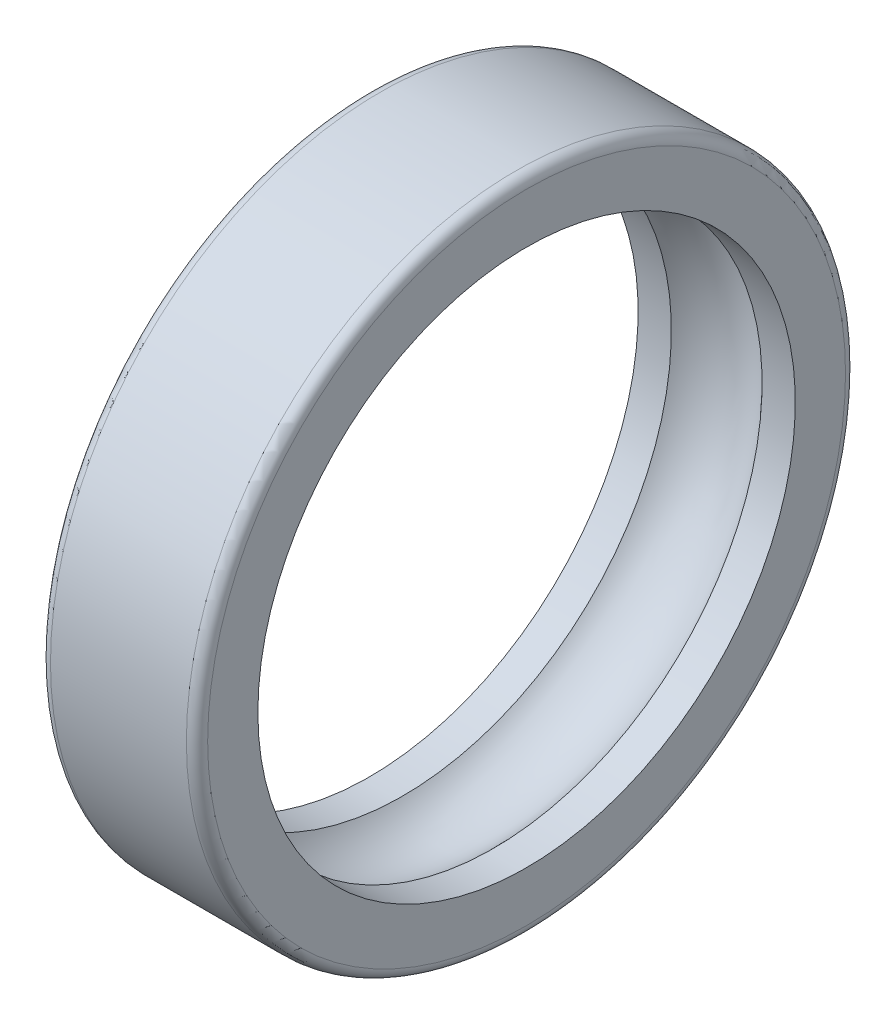
ISO-10303-21;
HEADER;
FILE_DESCRIPTION(('STEP AP214'),'2;1');
FILE_NAME('part.step','',(''),(''),'','','');
FILE_SCHEMA(('AUTOMOTIVE_DESIGN { 1 0 10303 214 1 1 1 1 }'));
ENDSEC;
DATA;
#1=APPLICATION_CONTEXT('core data for automotive mechanical design processes');
#2=APPLICATION_PROTOCOL_DEFINITION('international standard','automotive_design',2000,#1);
#3=PRODUCT_CONTEXT('',#1,'mechanical');
#4=PRODUCT('Part','Part','',(#3));
#5=PRODUCT_RELATED_PRODUCT_CATEGORY('part','',(#4));
#6=PRODUCT_DEFINITION_FORMATION('','',#4);
#7=PRODUCT_DEFINITION_CONTEXT('part definition',#1,'design');
#8=PRODUCT_DEFINITION('design','',#6,#7);
#9=PRODUCT_DEFINITION_SHAPE('','',#8);
#10=(LENGTH_UNIT() NAMED_UNIT(*) SI_UNIT(.MILLI.,.METRE.));
#11=(NAMED_UNIT(*) PLANE_ANGLE_UNIT() SI_UNIT($,.RADIAN.));
#12=(NAMED_UNIT(*) SI_UNIT($,.STERADIAN.) SOLID_ANGLE_UNIT());
#13=UNCERTAINTY_MEASURE_WITH_UNIT(LENGTH_MEASURE(1.E-05),#10,'distance_accuracy_value','');
#14=(GEOMETRIC_REPRESENTATION_CONTEXT(3) GLOBAL_UNCERTAINTY_ASSIGNED_CONTEXT((#13)) GLOBAL_UNIT_ASSIGNED_CONTEXT((#10,
#11,#12)) REPRESENTATION_CONTEXT('',''));
#15=CARTESIAN_POINT('',(0.,0.,0.));
#16=DIRECTION('',(0.,0.,1.));
#17=DIRECTION('',(1.,0.,0.));
#18=AXIS2_PLACEMENT_3D('',#15,#16,#17);
#19=CARTESIAN_POINT('',(0.,0.,0.));
#20=DIRECTION('',(-1.,0.,0.));
#21=DIRECTION('',(0.,0.,1.));
#22=AXIS2_PLACEMENT_3D('',#19,#20,#21);
#23=CYLINDRICAL_SURFACE('',#22,65.);
#24=CARTESIAN_POINT('',(-13.4,0.,0.));
#25=DIRECTION('',(1.,0.,0.));
#26=DIRECTION('',(0.,0.,-1.));
#27=AXIS2_PLACEMENT_3D('',#24,#25,#26);
#28=CIRCLE('',#27,65.);
#29=CARTESIAN_POINT('',(-13.4,0.,-65.));
#30=VERTEX_POINT('',#29);
#31=EDGE_CURVE('E46',#30,#30,#28,.T.);
#32=ORIENTED_EDGE('',*,*,#31,.T.);
#33=EDGE_LOOP('',(#32));
#34=FACE_BOUND('',#33,.T.);
#35=CARTESIAN_POINT('',(13.4,0.,0.));
#36=DIRECTION('',(1.,0.,0.));
#37=DIRECTION('',(0.,0.,-1.));
#38=AXIS2_PLACEMENT_3D('',#35,#36,#37);
#39=CIRCLE('',#38,65.);
#40=CARTESIAN_POINT('',(13.4,0.,-65.));
#41=VERTEX_POINT('',#40);
#42=EDGE_CURVE('E50',#41,#41,#39,.F.);
#43=ORIENTED_EDGE('',*,*,#42,.T.);
#44=EDGE_LOOP('',(#43));
#45=FACE_BOUND('',#44,.T.);
#46=ADVANCED_FACE('F39',(#34,#45),#23,.T.);
#47=CARTESIAN_POINT('',(15.5,65.,0.));
#48=DIRECTION('',(1.,0.,0.));
#49=DIRECTION('',(0.,0.,-1.));
#50=AXIS2_PLACEMENT_3D('',#47,#48,#49);
#51=PLANE('',#50);
#52=CARTESIAN_POINT('',(15.5,0.,0.));
#53=DIRECTION('',(1.,0.,0.));
#54=DIRECTION('',(0.,0.,-1.));
#55=AXIS2_PLACEMENT_3D('',#52,#53,#54);
#56=CIRCLE('',#55,62.9);
#57=CARTESIAN_POINT('',(15.5,0.,-62.9));
#58=VERTEX_POINT('',#57);
#59=EDGE_CURVE('E10',#58,#58,#56,.T.);
#60=ORIENTED_EDGE('',*,*,#59,.T.);
#61=EDGE_LOOP('',(#60));
#62=FACE_BOUND('',#61,.T.);
#63=CARTESIAN_POINT('',(15.5,0.,0.));
#64=DIRECTION('',(-1.,0.,0.));
#65=DIRECTION('',(0.,0.,1.));
#66=AXIS2_PLACEMENT_3D('',#63,#64,#65);
#67=CIRCLE('',#66,53.);
#68=CARTESIAN_POINT('',(15.5,0.,53.));
#69=VERTEX_POINT('',#68);
#70=EDGE_CURVE('E59',#69,#69,#67,.T.);
#71=ORIENTED_EDGE('',*,*,#70,.T.);
#72=EDGE_LOOP('',(#71));
#73=FACE_BOUND('',#72,.T.);
#74=ADVANCED_FACE('F88',(#62,#73),#51,.T.);
#75=CARTESIAN_POINT('',(0.,0.,0.));
#76=DIRECTION('',(-1.,0.,0.));
#77=DIRECTION('',(0.,0.,1.));
#78=AXIS2_PLACEMENT_3D('',#75,#76,#77);
#79=CYLINDRICAL_SURFACE('',#78,53.);
#80=ORIENTED_EDGE('',*,*,#70,.F.);
#81=EDGE_LOOP('',(#80));
#82=FACE_BOUND('',#81,.T.);
#83=CARTESIAN_POINT('',(8.94427190999916,0.,0.));
#84=DIRECTION('',(-1.,0.,0.));
#85=DIRECTION('',(0.,0.,1.));
#86=AXIS2_PLACEMENT_3D('',#83,#84,#85);
#87=CIRCLE('',#86,53.);
#88=CARTESIAN_POINT('',(8.94427190999916,0.,53.));
#89=VERTEX_POINT('',#88);
#90=EDGE_CURVE('E62',#89,#89,#87,.T.);
#91=ORIENTED_EDGE('',*,*,#90,.T.);
#92=EDGE_LOOP('',(#91));
#93=FACE_BOUND('',#92,.T.);
#94=ADVANCED_FACE('F93',(#82,#93),#79,.F.);
#95=CARTESIAN_POINT('',(0.,0.,0.));
#96=DIRECTION('',(-1.,0.,0.));
#97=DIRECTION('',(0.,0.,1.));
#98=AXIS2_PLACEMENT_3D('',#95,#96,#97);
#99=TOROIDAL_SURFACE('',#98,45.,12.);
#100=ORIENTED_EDGE('',*,*,#90,.F.);
#101=EDGE_LOOP('',(#100));
#102=FACE_BOUND('',#101,.T.);
#103=CARTESIAN_POINT('',(-8.94427190999916,0.,0.));
#104=DIRECTION('',(-1.,0.,0.));
#105=DIRECTION('',(0.,0.,1.));
#106=AXIS2_PLACEMENT_3D('',#103,#104,#105);
#107=CIRCLE('',#106,53.);
#108=CARTESIAN_POINT('',(-8.94427190999916,0.,53.));
#109=VERTEX_POINT('',#108);
#110=EDGE_CURVE('E65',#109,#109,#107,.T.);
#111=ORIENTED_EDGE('',*,*,#110,.T.);
#112=EDGE_LOOP('',(#111));
#113=FACE_BOUND('',#112,.T.);
#114=ADVANCED_FACE('F84',(#102,#113),#99,.F.);
#115=CARTESIAN_POINT('',(0.,0.,0.));
#116=DIRECTION('',(-1.,0.,0.));
#117=DIRECTION('',(0.,0.,1.));
#118=AXIS2_PLACEMENT_3D('',#115,#116,#117);
#119=CYLINDRICAL_SURFACE('',#118,53.);
#120=ORIENTED_EDGE('',*,*,#110,.F.);
#121=EDGE_LOOP('',(#120));
#122=FACE_BOUND('',#121,.T.);
#123=CARTESIAN_POINT('',(-15.5,0.,0.));
#124=DIRECTION('',(-1.,0.,0.));
#125=DIRECTION('',(0.,0.,1.));
#126=AXIS2_PLACEMENT_3D('',#123,#124,#125);
#127=CIRCLE('',#126,53.);
#128=CARTESIAN_POINT('',(-15.5,0.,53.));
#129=VERTEX_POINT('',#128);
#130=EDGE_CURVE('E68',#129,#129,#127,.T.);
#131=ORIENTED_EDGE('',*,*,#130,.T.);
#132=EDGE_LOOP('',(#131));
#133=FACE_BOUND('',#132,.T.);
#134=ADVANCED_FACE('F72',(#122,#133),#119,.F.);
#135=CARTESIAN_POINT('',(-15.5,65.,0.));
#136=DIRECTION('',(1.,0.,0.));
#137=DIRECTION('',(0.,0.,-1.));
#138=AXIS2_PLACEMENT_3D('',#135,#136,#137);
#139=PLANE('',#138);
#140=CARTESIAN_POINT('',(-15.5,0.,0.));
#141=DIRECTION('',(1.,0.,0.));
#142=DIRECTION('',(0.,0.,-1.));
#143=AXIS2_PLACEMENT_3D('',#140,#141,#142);
#144=CIRCLE('',#143,62.9);
#145=CARTESIAN_POINT('',(-15.5,0.,-62.9));
#146=VERTEX_POINT('',#145);
#147=EDGE_CURVE('E54',#146,#146,#144,.F.);
#148=ORIENTED_EDGE('',*,*,#147,.T.);
#149=EDGE_LOOP('',(#148));
#150=FACE_BOUND('',#149,.T.);
#151=ORIENTED_EDGE('',*,*,#130,.F.);
#152=EDGE_LOOP('',(#151));
#153=FACE_BOUND('',#152,.T.);
#154=ADVANCED_FACE('F74',(#150,#153),#139,.F.);
#155=CARTESIAN_POINT('',(-13.4,0.,0.));
#156=DIRECTION('',(1.,0.,0.));
#157=DIRECTION('',(0.,0.,-1.));
#158=AXIS2_PLACEMENT_3D('',#155,#156,#157);
#159=TOROIDAL_SURFACE('',#158,62.9,2.1);
#160=ORIENTED_EDGE('',*,*,#31,.F.);
#161=EDGE_LOOP('',(#160));
#162=FACE_BOUND('',#161,.T.);
#163=ORIENTED_EDGE('',*,*,#147,.F.);
#164=EDGE_LOOP('',(#163));
#165=FACE_BOUND('',#164,.T.);
#166=ADVANCED_FACE('F76',(#162,#165),#159,.T.);
#167=CARTESIAN_POINT('',(13.4,0.,0.));
#168=DIRECTION('',(1.,0.,0.));
#169=DIRECTION('',(0.,0.,-1.));
#170=AXIS2_PLACEMENT_3D('',#167,#168,#169);
#171=TOROIDAL_SURFACE('',#170,62.9,2.1);
#172=ORIENTED_EDGE('',*,*,#59,.F.);
#173=EDGE_LOOP('',(#172));
#174=FACE_BOUND('',#173,.T.);
#175=ORIENTED_EDGE('',*,*,#42,.F.);
#176=EDGE_LOOP('',(#175));
#177=FACE_BOUND('',#176,.T.);
#178=ADVANCED_FACE('F41',(#174,#177),#171,.T.);
#179=CLOSED_SHELL('',(#46,#74,#94,#114,#134,#154,#166,#178));
#180=MANIFOLD_SOLID_BREP('B2',#179);
#181=ADVANCED_BREP_SHAPE_REPRESENTATION('',(#18,#180),#14);
#182=SHAPE_DEFINITION_REPRESENTATION(#9,#181);
ENDSEC;
END-ISO-10303-21;
